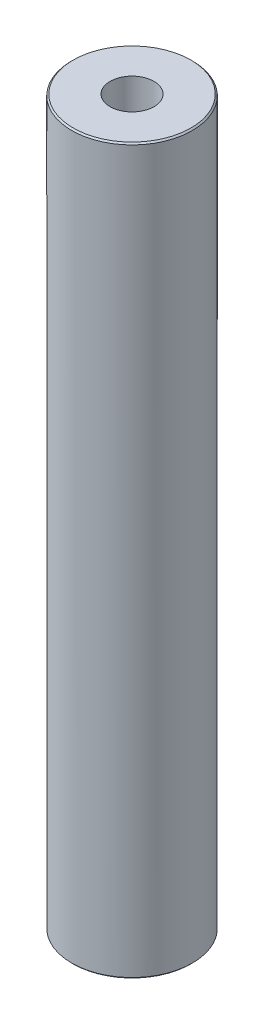
ISO-10303-21;
HEADER;
FILE_DESCRIPTION(('STEP AP214'),'2;1');
FILE_NAME('part.step','',(''),(''),'','','');
FILE_SCHEMA(('AUTOMOTIVE_DESIGN { 1 0 10303 214 1 1 1 1 }'));
ENDSEC;
DATA;
#1=APPLICATION_CONTEXT('core data for automotive mechanical design processes');
#2=APPLICATION_PROTOCOL_DEFINITION('international standard','automotive_design',2000,#1);
#3=PRODUCT_CONTEXT('',#1,'mechanical');
#4=PRODUCT('Part','Part','',(#3));
#5=PRODUCT_RELATED_PRODUCT_CATEGORY('part','',(#4));
#6=PRODUCT_DEFINITION_FORMATION('','',#4);
#7=PRODUCT_DEFINITION_CONTEXT('part definition',#1,'design');
#8=PRODUCT_DEFINITION('design','',#6,#7);
#9=PRODUCT_DEFINITION_SHAPE('','',#8);
#10=(LENGTH_UNIT() NAMED_UNIT(*) SI_UNIT(.MILLI.,.METRE.));
#11=(NAMED_UNIT(*) PLANE_ANGLE_UNIT() SI_UNIT($,.RADIAN.));
#12=(NAMED_UNIT(*) SI_UNIT($,.STERADIAN.) SOLID_ANGLE_UNIT());
#13=UNCERTAINTY_MEASURE_WITH_UNIT(LENGTH_MEASURE(1.E-05),#10,'distance_accuracy_value','');
#14=(GEOMETRIC_REPRESENTATION_CONTEXT(3) GLOBAL_UNCERTAINTY_ASSIGNED_CONTEXT((#13)) GLOBAL_UNIT_ASSIGNED_CONTEXT((#10,
#11,#12)) REPRESENTATION_CONTEXT('',''));
#15=CARTESIAN_POINT('',(0.,0.,0.));
#16=DIRECTION('',(0.,0.,1.));
#17=DIRECTION('',(1.,0.,0.));
#18=AXIS2_PLACEMENT_3D('',#15,#16,#17);
#19=CARTESIAN_POINT('',(0.,600.,0.));
#20=DIRECTION('',(0.,-1.,0.));
#21=DIRECTION('',(0.,0.,-1.));
#22=AXIS2_PLACEMENT_3D('',#19,#20,#21);
#23=CYLINDRICAL_SURFACE('',#22,50.);
#24=CARTESIAN_POINT('',(0.,598.803924672471,0.));
#25=DIRECTION('',(0.,1.,0.));
#26=DIRECTION('',(0.,0.,1.));
#27=AXIS2_PLACEMENT_3D('',#24,#25,#26);
#28=CIRCLE('',#27,50.);
#29=CARTESIAN_POINT('',(0.,598.803924672471,-50.0000000000001));
#30=VERTEX_POINT('',#29);
#31=EDGE_CURVE('E50',#30,#30,#28,.F.);
#32=ORIENTED_EDGE('',*,*,#31,.T.);
#33=EDGE_LOOP('',(#32));
#34=FACE_BOUND('',#33,.T.);
#35=CARTESIAN_POINT('',(0.,1.19607532752875,0.));
#36=DIRECTION('',(0.,1.,0.));
#37=DIRECTION('',(0.,0.,1.));
#38=AXIS2_PLACEMENT_3D('',#35,#36,#37);
#39=CIRCLE('',#38,50.);
#40=CARTESIAN_POINT('',(0.,1.19607532752875,50.));
#41=VERTEX_POINT('',#40);
#42=EDGE_CURVE('E51',#41,#41,#39,.T.);
#43=ORIENTED_EDGE('',*,*,#42,.T.);
#44=EDGE_LOOP('',(#43));
#45=FACE_BOUND('',#44,.T.);
#46=ADVANCED_FACE('F39',(#34,#45),#23,.T.);
#47=CARTESIAN_POINT('',(0.,600.,0.));
#48=DIRECTION('',(0.,1.,0.));
#49=DIRECTION('',(0.,0.,1.));
#50=AXIS2_PLACEMENT_3D('',#47,#48,#49);
#51=PLANE('',#50);
#52=CARTESIAN_POINT('',(0.,600.,0.));
#53=DIRECTION('',(0.,1.,0.));
#54=DIRECTION('',(0.,0.,1.));
#55=AXIS2_PLACEMENT_3D('',#52,#53,#54);
#56=CIRCLE('',#55,48.8039246724712);
#57=CARTESIAN_POINT('',(0.,600.,-48.8039246724713));
#58=VERTEX_POINT('',#57);
#59=EDGE_CURVE('E54',#58,#58,#56,.T.);
#60=ORIENTED_EDGE('',*,*,#59,.T.);
#61=EDGE_LOOP('',(#60));
#62=FACE_BOUND('',#61,.T.);
#63=CARTESIAN_POINT('',(0.,600.,0.));
#64=DIRECTION('',(0.,1.,0.));
#65=DIRECTION('',(0.,0.,1.));
#66=AXIS2_PLACEMENT_3D('',#63,#64,#65);
#67=CIRCLE('',#66,18.2002824565062);
#68=CARTESIAN_POINT('',(0.,600.,18.2002824565062));
#69=VERTEX_POINT('',#68);
#70=EDGE_CURVE('E58',#69,#69,#67,.T.);
#71=ORIENTED_EDGE('',*,*,#70,.F.);
#72=EDGE_LOOP('',(#71));
#73=FACE_BOUND('',#72,.T.);
#74=ADVANCED_FACE('F69',(#62,#73),#51,.T.);
#75=CARTESIAN_POINT('',(0.,0.,0.));
#76=DIRECTION('',(0.,1.,0.));
#77=DIRECTION('',(0.,0.,1.));
#78=AXIS2_PLACEMENT_3D('',#75,#76,#77);
#79=PLANE('',#78);
#80=CARTESIAN_POINT('',(0.,0.,0.));
#81=DIRECTION('',(0.,1.,0.));
#82=DIRECTION('',(0.,0.,1.));
#83=AXIS2_PLACEMENT_3D('',#80,#81,#82);
#84=CIRCLE('',#83,48.8039246724712);
#85=CARTESIAN_POINT('',(0.,0.,48.8039246724712));
#86=VERTEX_POINT('',#85);
#87=EDGE_CURVE('E10',#86,#86,#84,.F.);
#88=ORIENTED_EDGE('',*,*,#87,.T.);
#89=EDGE_LOOP('',(#88));
#90=FACE_BOUND('',#89,.T.);
#91=CARTESIAN_POINT('',(0.,0.,0.));
#92=DIRECTION('',(0.,1.,0.));
#93=DIRECTION('',(0.,0.,1.));
#94=AXIS2_PLACEMENT_3D('',#91,#92,#93);
#95=CIRCLE('',#94,18.2002824565062);
#96=CARTESIAN_POINT('',(0.,0.,18.2002824565062));
#97=VERTEX_POINT('',#96);
#98=EDGE_CURVE('E63',#97,#97,#95,.T.);
#99=ORIENTED_EDGE('',*,*,#98,.T.);
#100=EDGE_LOOP('',(#99));
#101=FACE_BOUND('',#100,.T.);
#102=ADVANCED_FACE('F75',(#90,#101),#79,.F.);
#103=CARTESIAN_POINT('',(0.,600.,0.));
#104=DIRECTION('',(0.,-1.,0.));
#105=DIRECTION('',(0.,0.,-1.));
#106=AXIS2_PLACEMENT_3D('',#103,#104,#105);
#107=CYLINDRICAL_SURFACE('',#106,18.2002824565062);
#108=ORIENTED_EDGE('',*,*,#70,.T.);
#109=EDGE_LOOP('',(#108));
#110=FACE_BOUND('',#109,.T.);
#111=ORIENTED_EDGE('',*,*,#98,.F.);
#112=EDGE_LOOP('',(#111));
#113=FACE_BOUND('',#112,.T.);
#114=ADVANCED_FACE('F70',(#110,#113),#107,.F.);
#115=CARTESIAN_POINT('',(0.,600.,0.));
#116=DIRECTION('',(0.,-1.,0.));
#117=DIRECTION('',(0.,0.,-1.));
#118=AXIS2_PLACEMENT_3D('',#115,#116,#117);
#119=CONICAL_SURFACE('',#118,48.8039246724712,0.785398163397411);
#120=CARTESIAN_POINT('',(0.,598.803924672471,-50.0000000000001));
#121=CARTESIAN_POINT('',(0.,598.816383790466,-49.987540882005));
#122=CARTESIAN_POINT('',(0.,598.828842908461,-49.9750817640099));
#123=CARTESIAN_POINT('',(0.,598.853761144451,-49.9501635280197));
#124=CARTESIAN_POINT('',(0.,598.866220262447,-49.9377044100246));
#125=CARTESIAN_POINT('',(0.,598.891138498437,-49.9127861740344));
#126=CARTESIAN_POINT('',(0.,598.903597616432,-49.9003270560393));
#127=CARTESIAN_POINT('',(0.,598.928515852422,-49.8754088200492));
#128=CARTESIAN_POINT('',(0.,598.940974970417,-49.8629497020541));
#129=CARTESIAN_POINT('',(0.,598.965893206407,-49.8380314660639));
#130=CARTESIAN_POINT('',(0.,598.978352324402,-49.8255723480688));
#131=CARTESIAN_POINT('',(0.,599.003270560392,-49.8006541120786));
#132=CARTESIAN_POINT('',(0.,599.015729678388,-49.7881949940835));
#133=CARTESIAN_POINT('',(0.,599.040647914378,-49.7632767580933));
#134=CARTESIAN_POINT('',(0.,599.053107032373,-49.7508176400982));
#135=CARTESIAN_POINT('',(0.,599.078025268363,-49.725899404108));
#136=CARTESIAN_POINT('',(0.,599.090484386358,-49.713440286113));
#137=CARTESIAN_POINT('',(0.,599.115402622348,-49.6885220501228));
#138=CARTESIAN_POINT('',(0.,599.127861740344,-49.6760629321277));
#139=CARTESIAN_POINT('',(0.,599.152779976334,-49.6511446961375));
#140=CARTESIAN_POINT('',(0.,599.165239094329,-49.6386855781424));
#141=CARTESIAN_POINT('',(0.,599.190157330319,-49.6137673421522));
#142=CARTESIAN_POINT('',(0.,599.202616448314,-49.6013082241571));
#143=CARTESIAN_POINT('',(0.,599.227534684304,-49.576389988167));
#144=CARTESIAN_POINT('',(0.,599.239993802299,-49.5639308701719));
#145=CARTESIAN_POINT('',(0.,599.264912038289,-49.5390126341817));
#146=CARTESIAN_POINT('',(0.,599.277371156285,-49.5265535161866));
#147=CARTESIAN_POINT('',(0.,599.302289392275,-49.5016352801964));
#148=CARTESIAN_POINT('',(0.,599.31474851027,-49.4891761622013));
#149=CARTESIAN_POINT('',(0.,599.33966674626,-49.4642579262111));
#150=CARTESIAN_POINT('',(0.,599.352125864255,-49.451798808216));
#151=CARTESIAN_POINT('',(0.,599.377044100245,-49.4268805722258));
#152=CARTESIAN_POINT('',(0.,599.389503218241,-49.4144214542308));
#153=CARTESIAN_POINT('',(0.,599.414421454231,-49.3895032182406));
#154=CARTESIAN_POINT('',(0.,599.426880572226,-49.3770441002455));
#155=CARTESIAN_POINT('',(0.,599.451798808216,-49.3521258642553));
#156=CARTESIAN_POINT('',(0.,599.464257926211,-49.3396667462602));
#157=CARTESIAN_POINT('',(0.,599.489176162201,-49.31474851027));
#158=CARTESIAN_POINT('',(0.,599.501635280196,-49.302289392275));
#159=CARTESIAN_POINT('',(0.,599.526553516186,-49.2773711562848));
#160=CARTESIAN_POINT('',(0.,599.539012634182,-49.2649120382897));
#161=CARTESIAN_POINT('',(0.,599.563930870172,-49.2399938022995));
#162=CARTESIAN_POINT('',(0.,599.576389988167,-49.2275346843044));
#163=CARTESIAN_POINT('',(0.,599.601308224157,-49.2026164483142));
#164=CARTESIAN_POINT('',(0.,599.613767342152,-49.1901573303191));
#165=CARTESIAN_POINT('',(0.,599.638685578142,-49.1652390943289));
#166=CARTESIAN_POINT('',(0.,599.651144696137,-49.1527799763338));
#167=CARTESIAN_POINT('',(0.,599.676062932127,-49.1278617403437));
#168=CARTESIAN_POINT('',(0.,599.688522050123,-49.1154026223486));
#169=CARTESIAN_POINT('',(0.,599.713440286113,-49.0904843863584));
#170=CARTESIAN_POINT('',(0.,599.725899404108,-49.0780252683633));
#171=CARTESIAN_POINT('',(0.,599.750817640098,-49.0531070323731));
#172=CARTESIAN_POINT('',(0.,599.763276758093,-49.040647914378));
#173=CARTESIAN_POINT('',(0.,599.788194994083,-49.0157296783878));
#174=CARTESIAN_POINT('',(0.,599.800654112079,-49.0032705603928));
#175=CARTESIAN_POINT('',(0.,599.825572348069,-48.9783523244026));
#176=CARTESIAN_POINT('',(0.,599.838031466064,-48.9658932064075));
#177=CARTESIAN_POINT('',(0.,599.862949702054,-48.9409749704173));
#178=CARTESIAN_POINT('',(0.,599.875408820049,-48.9285158524222));
#179=CARTESIAN_POINT('',(0.,599.900327056039,-48.903597616432));
#180=CARTESIAN_POINT('',(0.,599.912786174034,-48.8911384984369));
#181=CARTESIAN_POINT('',(0.,599.937704410024,-48.8662202624468));
#182=CARTESIAN_POINT('',(0.,599.95016352802,-48.8537611444517));
#183=CARTESIAN_POINT('',(0.,599.97508176401,-48.8288429084615));
#184=CARTESIAN_POINT('',(0.,599.987540882005,-48.8163837904664));
#185=CARTESIAN_POINT('',(0.,600.,-48.8039246724713));
#186=B_SPLINE_CURVE_WITH_KNOTS('',3,(#120,#121,#122,#123,#124,#125,#126,#127,#128,#129,#130,
#131,#132,#133,#134,#135,#136,#137,#138,#139,#140,#141,#142,#143,#144,#145,#146,#147,#148,#149,
#150,#151,#152,#153,#154,#155,#156,#157,#158,#159,#160,#161,#162,#163,#164,#165,#166,#167,#168,
#169,#170,#171,#172,#173,#174,#175,#176,#177,#178,#179,#180,#181,#182,#183,#184,#185),
.UNSPECIFIED.,.F.,.F.,(4,2,2,2,2,2,2,2,2,2,2,2,2,2,2,2,2,2,2,2,2,2,2,2,2,2,2,2,2,2,2,2,4),(0.,
0.052859560931569,0.105719121863133,0.158578682794781,0.211438243726345,0.264297804657914,
0.317157365589561,0.370016926521125,0.422876487452773,0.475736048384337,0.528595609315906,
0.581455170247553,0.634314731179117,0.687174292110686,0.740033853042329,0.792893413973898,
0.845752974905546,0.89861253583711,0.951472096768679,1.00433165770032,1.05719121863189,
1.11005077956345,1.1629103404951,1.21576990142667,1.26862946235831,1.32148902328988,
1.37434858422145,1.42720814515309,1.48006770608466,1.53292726701623,1.58578682794787,
1.63864638887944,1.69150594981109),.UNSPECIFIED.);
#187=EDGE_CURVE('BSEAM81',#30,#58,#186,.T.);
#188=ORIENTED_EDGE('',*,*,#31,.F.);
#189=ORIENTED_EDGE('',*,*,#59,.F.);
#190=ORIENTED_EDGE('',*,*,#187,.T.);
#191=ORIENTED_EDGE('',*,*,#187,.F.);
#192=EDGE_LOOP('',(#188,#190,#189,#191));
#193=FACE_BOUND('',#192,.T.);
#194=ADVANCED_FACE('F81',(#193),#119,.T.);
#195=CARTESIAN_POINT('',(0.,1.19607532752875,0.));
#196=DIRECTION('',(0.,1.,0.));
#197=DIRECTION('',(0.,0.,1.));
#198=AXIS2_PLACEMENT_3D('',#195,#196,#197);
#199=CONICAL_SURFACE('',#198,50.,0.785398163397474);
#200=ORIENTED_EDGE('',*,*,#87,.F.);
#201=EDGE_LOOP('',(#200));
#202=FACE_BOUND('',#201,.T.);
#203=ORIENTED_EDGE('',*,*,#42,.F.);
#204=EDGE_LOOP('',(#203));
#205=FACE_BOUND('',#204,.T.);
#206=ADVANCED_FACE('F45',(#202,#205),#199,.T.);
#207=CLOSED_SHELL('',(#46,#74,#102,#114,#194,#206));
#208=MANIFOLD_SOLID_BREP('B2',#207);
#209=ADVANCED_BREP_SHAPE_REPRESENTATION('',(#18,#208),#14);
#210=SHAPE_DEFINITION_REPRESENTATION(#9,#209);
ENDSEC;
END-ISO-10303-21;
